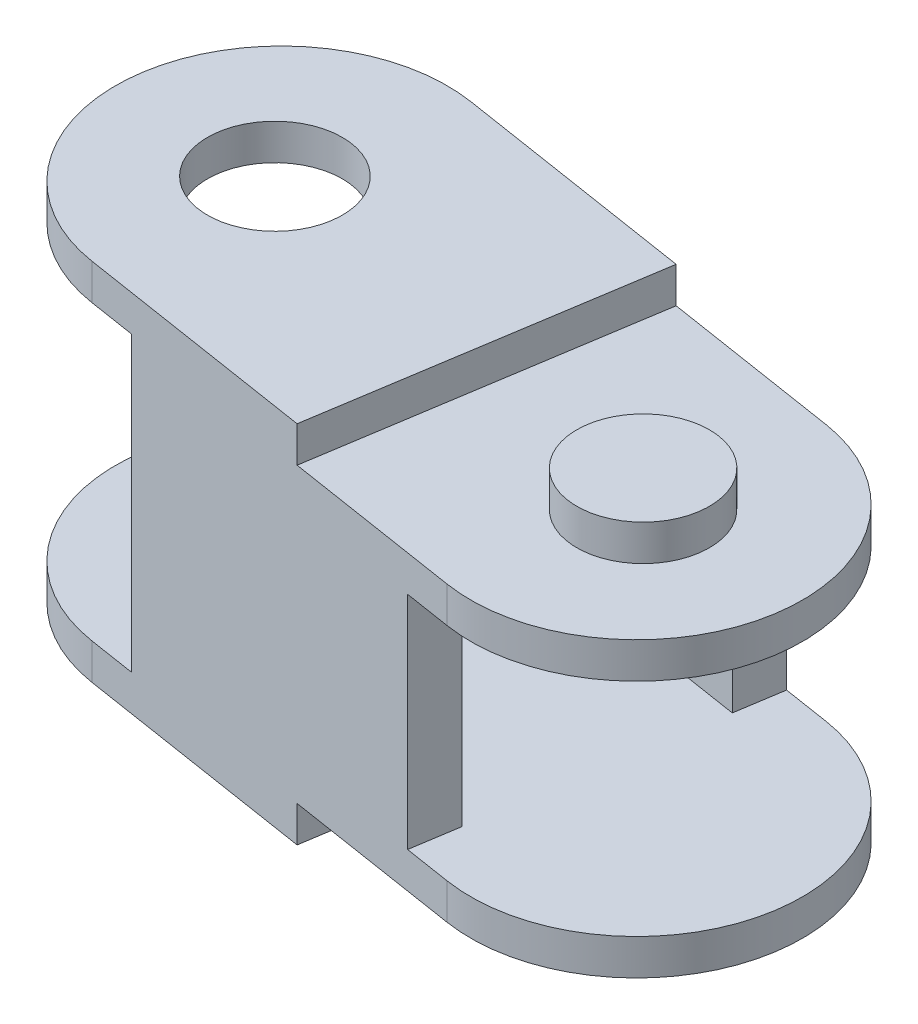
ISO-10303-21;
HEADER;
FILE_DESCRIPTION(('STEP AP214'),'2;1');
FILE_NAME('part.step','',(''),(''),'','','');
FILE_SCHEMA(('AUTOMOTIVE_DESIGN { 1 0 10303 214 1 1 1 1 }'));
ENDSEC;
DATA;
#1=APPLICATION_CONTEXT('core data for automotive mechanical design processes');
#2=APPLICATION_PROTOCOL_DEFINITION('international standard','automotive_design',2000,#1);
#3=PRODUCT_CONTEXT('',#1,'mechanical');
#4=PRODUCT('Part','Part','',(#3));
#5=PRODUCT_RELATED_PRODUCT_CATEGORY('part','',(#4));
#6=PRODUCT_DEFINITION_FORMATION('','',#4);
#7=PRODUCT_DEFINITION_CONTEXT('part definition',#1,'design');
#8=PRODUCT_DEFINITION('design','',#6,#7);
#9=PRODUCT_DEFINITION_SHAPE('','',#8);
#10=(LENGTH_UNIT() NAMED_UNIT(*) SI_UNIT(.MILLI.,.METRE.));
#11=(NAMED_UNIT(*) PLANE_ANGLE_UNIT() SI_UNIT($,.RADIAN.));
#12=(NAMED_UNIT(*) SI_UNIT($,.STERADIAN.) SOLID_ANGLE_UNIT());
#13=UNCERTAINTY_MEASURE_WITH_UNIT(LENGTH_MEASURE(1.E-05),#10,'distance_accuracy_value','');
#14=(GEOMETRIC_REPRESENTATION_CONTEXT(3) GLOBAL_UNCERTAINTY_ASSIGNED_CONTEXT((#13)) GLOBAL_UNIT_ASSIGNED_CONTEXT((#10,
#11,#12)) REPRESENTATION_CONTEXT('',''));
#15=CARTESIAN_POINT('',(0.,0.,0.));
#16=DIRECTION('',(0.,0.,1.));
#17=DIRECTION('',(1.,0.,0.));
#18=AXIS2_PLACEMENT_3D('',#15,#16,#17);
#19=CARTESIAN_POINT('',(-120.000000004537,13.25,55.9999999957728));
#20=DIRECTION('',(0.,1.,0.));
#21=DIRECTION('',(0.,0.,1.));
#22=AXIS2_PLACEMENT_3D('',#19,#20,#21);
#23=PLANE('',#22);
#24=CARTESIAN_POINT('',(-120.000000004537,13.25,55.9999999957728));
#25=DIRECTION('',(0.,-1.,0.));
#26=DIRECTION('',(0.,0.,-1.));
#27=AXIS2_PLACEMENT_3D('',#24,#25,#26);
#28=CIRCLE('',#27,3.);
#29=CARTESIAN_POINT('',(-120.000000004537,13.25,52.9999999957728));
#30=VERTEX_POINT('',#29);
#31=EDGE_CURVE('E20',#30,#30,#28,.T.);
#32=ORIENTED_EDGE('',*,*,#31,.F.);
#33=EDGE_LOOP('',(#32));
#34=FACE_BOUND('',#33,.T.);
#35=ADVANCED_FACE('F17',(#34),#23,.T.);
#36=CARTESIAN_POINT('',(-120.000000004537,-3.25,55.9999999957728));
#37=DIRECTION('',(0.,-1.,0.));
#38=DIRECTION('',(0.,0.,-1.));
#39=AXIS2_PLACEMENT_3D('',#36,#37,#38);
#40=PLANE('',#39);
#41=CARTESIAN_POINT('',(-120.000000004537,-3.25,55.9999999957728));
#42=DIRECTION('',(0.,-1.,0.));
#43=DIRECTION('',(0.,0.,-1.));
#44=AXIS2_PLACEMENT_3D('',#41,#42,#43);
#45=CIRCLE('',#44,3.);
#46=CARTESIAN_POINT('',(-120.000000004537,-3.25,52.9999999957728));
#47=VERTEX_POINT('',#46);
#48=EDGE_CURVE('E301',#47,#47,#45,.F.);
#49=ORIENTED_EDGE('',*,*,#48,.F.);
#50=EDGE_LOOP('',(#49));
#51=FACE_BOUND('',#50,.T.);
#52=ADVANCED_FACE('F418',(#51),#40,.T.);
#53=CARTESIAN_POINT('',(-137.288222963067,5.,53.2857142819716));
#54=DIRECTION('',(-0.987898454773161,0.,-0.155102040788641));
#55=DIRECTION('',(-0.155102040788641,0.,0.987898454773161));
#56=AXIS2_PLACEMENT_3D('',#53,#54,#55);
#57=PLANE('',#56);
#58=DIRECTION('',(0.,1.,0.));
#59=VECTOR('',#58,1.);
#60=CARTESIAN_POINT('',(-136.458427044848,5.,48.0004575489351));
#61=LINE('',#60,#59);
#62=CARTESIAN_POINT('',(-136.458427044848,10.,48.0004575489352));
#63=VERTEX_POINT('',#62);
#64=CARTESIAN_POINT('',(-136.458427044848,0.,48.0004575489352));
#65=VERTEX_POINT('',#64);
#66=EDGE_CURVE('E147',#63,#65,#61,.F.);
#67=ORIENTED_EDGE('',*,*,#66,.F.);
#68=DIRECTION('',(0.15510204078861,0.,-0.987898454773166));
#69=VECTOR('',#68,1.);
#70=CARTESIAN_POINT('',(-136.458427044848,10.,48.0004575489352));
#71=LINE('',#70,#69);
#72=CARTESIAN_POINT('',(-136.158637044364,10.,46.090991517871));
#73=VERTEX_POINT('',#72);
#74=EDGE_CURVE('E344',#63,#73,#71,.T.);
#75=ORIENTED_EDGE('',*,*,#74,.T.);
#76=DIRECTION('',(0.,1.,0.));
#77=VECTOR('',#76,1.);
#78=CARTESIAN_POINT('',(-136.158637044364,5.,46.090991517871));
#79=LINE('',#78,#77);
#80=CARTESIAN_POINT('',(-136.158637044364,11.625,46.090991517871));
#81=VERTEX_POINT('',#80);
#82=EDGE_CURVE('E162',#73,#81,#79,.T.);
#83=ORIENTED_EDGE('',*,*,#82,.T.);
#84=DIRECTION('',(-0.155102040788641,0.,0.987898454773161));
#85=VECTOR('',#84,1.);
#86=CARTESIAN_POINT('',(-137.288222963067,11.625,53.2857142819716));
#87=LINE('',#86,#85);
#88=CARTESIAN_POINT('',(-136.124957657152,11.625,45.8764758711729));
#89=VERTEX_POINT('',#88);
#90=EDGE_CURVE('E157',#81,#89,#87,.F.);
#91=ORIENTED_EDGE('',*,*,#90,.T.);
#92=DIRECTION('',(0.,1.,0.));
#93=VECTOR('',#92,1.);
#94=CARTESIAN_POINT('',(-136.124957657152,-3.25,45.876475871173));
#95=LINE('',#94,#93);
#96=CARTESIAN_POINT('',(-136.124957657152,-1.625,45.8764758711729));
#97=VERTEX_POINT('',#96);
#98=EDGE_CURVE('E160',#97,#89,#95,.T.);
#99=ORIENTED_EDGE('',*,*,#98,.F.);
#100=DIRECTION('',(-0.155102040788641,0.,0.987898454773161));
#101=VECTOR('',#100,1.);
#102=CARTESIAN_POINT('',(-137.288222963067,-1.625,53.2857142819716));
#103=LINE('',#102,#101);
#104=CARTESIAN_POINT('',(-136.158637044364,-1.625,46.090991517871));
#105=VERTEX_POINT('',#104);
#106=EDGE_CURVE('E166',#97,#105,#103,.T.);
#107=ORIENTED_EDGE('',*,*,#106,.T.);
#108=DIRECTION('',(0.,-1.,0.));
#109=VECTOR('',#108,1.);
#110=CARTESIAN_POINT('',(-136.158637044364,-0.8125,46.0909915178709));
#111=LINE('',#110,#109);
#112=CARTESIAN_POINT('',(-136.158637044364,0.,46.0909915178709));
#113=VERTEX_POINT('',#112);
#114=EDGE_CURVE('E141',#105,#113,#111,.F.);
#115=ORIENTED_EDGE('',*,*,#114,.T.);
#116=DIRECTION('',(-0.15510204078861,0.,0.987898454773166));
#117=VECTOR('',#116,1.);
#118=CARTESIAN_POINT('',(-136.158637044364,0.,46.090991517871));
#119=LINE('',#118,#117);
#120=EDGE_CURVE('E346',#113,#65,#119,.T.);
#121=ORIENTED_EDGE('',*,*,#120,.T.);
#122=EDGE_LOOP('',(#67,#75,#83,#91,#99,#107,#115,#121));
#123=FACE_BOUND('',#122,.T.);
#124=ADVANCED_FACE('F159',(#123),#57,.T.);
#125=CARTESIAN_POINT('',(-139.7579691,0.,52.89795918));
#126=DIRECTION('',(0.,1.,0.));
#127=DIRECTION('',(0.,0.,1.));
#128=AXIS2_PLACEMENT_3D('',#125,#126,#127);
#129=PLANE('',#128);
#130=CARTESIAN_POINT('',(-139.7579691,0.,52.89795918));
#131=DIRECTION('',(0.,-1.,0.));
#132=DIRECTION('',(0.,0.,-1.));
#133=AXIS2_PLACEMENT_3D('',#130,#131,#132);
#134=CIRCLE('',#133,7.7);
#135=CARTESIAN_POINT('',(-133.457364932623,0.,48.471630325743));
#136=VERTEX_POINT('',#135);
#137=EDGE_CURVE('E315',#113,#136,#134,.T.);
#138=ORIENTED_EDGE('',*,*,#137,.T.);
#139=DIRECTION('',(0.987898454773161,0.,0.155102040788641));
#140=VECTOR('',#139,1.);
#141=CARTESIAN_POINT('',(-126.579442497116,0.,49.5514779568216));
#142=LINE('',#141,#140);
#143=EDGE_CURVE('E239',#65,#136,#142,.T.);
#144=ORIENTED_EDGE('',*,*,#143,.F.);
#145=ORIENTED_EDGE('',*,*,#120,.F.);
#146=EDGE_LOOP('',(#138,#144,#145));
#147=FACE_BOUND('',#146,.T.);
#148=ADVANCED_FACE('F425',(#147),#129,.F.);
#149=CARTESIAN_POINT('',(-139.7579691,10.,52.89795918));
#150=DIRECTION('',(0.,-1.,0.));
#151=DIRECTION('',(0.,0.,-1.));
#152=AXIS2_PLACEMENT_3D('',#149,#150,#151);
#153=PLANE('',#152);
#154=DIRECTION('',(0.987898454773161,0.,0.155102040788641));
#155=VECTOR('',#154,1.);
#156=CARTESIAN_POINT('',(-126.579442497116,10.,49.5514779568216));
#157=LINE('',#156,#155);
#158=CARTESIAN_POINT('',(-133.457364932623,10.,48.471630325743));
#159=VERTEX_POINT('',#158);
#160=EDGE_CURVE('E230',#159,#63,#157,.F.);
#161=ORIENTED_EDGE('',*,*,#160,.F.);
#162=CARTESIAN_POINT('',(-139.7579691,10.,52.89795918));
#163=DIRECTION('',(0.,-1.,0.));
#164=DIRECTION('',(0.,0.,-1.));
#165=AXIS2_PLACEMENT_3D('',#162,#163,#164);
#166=CIRCLE('',#165,7.7);
#167=EDGE_CURVE('E233',#159,#73,#166,.F.);
#168=ORIENTED_EDGE('',*,*,#167,.T.);
#169=ORIENTED_EDGE('',*,*,#74,.F.);
#170=EDGE_LOOP('',(#161,#168,#169));
#171=FACE_BOUND('',#170,.T.);
#172=ADVANCED_FACE('F541',(#171),#153,.F.);
#173=CARTESIAN_POINT('',(-120.000000004537,12.4375,55.9999999957728));
#174=DIRECTION('',(0.,-1.,0.));
#175=DIRECTION('',(0.,0.,-1.));
#176=AXIS2_PLACEMENT_3D('',#173,#174,#175);
#177=CYLINDRICAL_SURFACE('',#176,3.);
#178=CARTESIAN_POINT('',(-120.000000004537,11.625,55.9999999957728));
#179=DIRECTION('',(0.,-1.,0.));
#180=DIRECTION('',(0.,0.,-1.));
#181=AXIS2_PLACEMENT_3D('',#178,#179,#180);
#182=CIRCLE('',#181,3.);
#183=CARTESIAN_POINT('',(-120.000000004537,11.625,52.9999999957728));
#184=VERTEX_POINT('',#183);
#185=EDGE_CURVE('E404',#184,#184,#182,.T.);
#186=ORIENTED_EDGE('',*,*,#185,.F.);
#187=EDGE_LOOP('',(#186));
#188=FACE_BOUND('',#187,.T.);
#189=ORIENTED_EDGE('',*,*,#31,.T.);
#190=EDGE_LOOP('',(#189));
#191=FACE_BOUND('',#190,.T.);
#192=ADVANCED_FACE('F537',(#188,#191),#177,.T.);
#193=CARTESIAN_POINT('',(-128.397136870109,12.4375,54.6816326490694));
#194=DIRECTION('',(0.987898454773161,0.,0.155102040788641));
#195=DIRECTION('',(0.155102040788641,0.,-0.987898454773161));
#196=AXIS2_PLACEMENT_3D('',#193,#194,#195);
#197=PLANE('',#196);
#198=DIRECTION('',(-0.155102040788601,0.,0.987898454773167));
#199=VECTOR('',#198,1.);
#200=CARTESIAN_POINT('',(-127.233871564194,11.625,47.2723942382707));
#201=LINE('',#200,#199);
#202=CARTESIAN_POINT('',(-127.233871564194,11.625,47.2723942382707));
#203=VERTEX_POINT('',#202);
#204=CARTESIAN_POINT('',(-129.560402176013,11.625,62.0908710598022));
#205=VERTEX_POINT('',#204);
#206=EDGE_CURVE('E217',#203,#205,#201,.T.);
#207=ORIENTED_EDGE('',*,*,#206,.F.);
#208=DIRECTION('',(0.,1.,0.));
#209=VECTOR('',#208,1.);
#210=CARTESIAN_POINT('',(-127.233871564194,-3.25,47.2723942382707));
#211=LINE('',#210,#209);
#212=CARTESIAN_POINT('',(-127.233871564194,13.25,47.2723942382707));
#213=VERTEX_POINT('',#212);
#214=EDGE_CURVE('E258',#213,#203,#211,.F.);
#215=ORIENTED_EDGE('',*,*,#214,.F.);
#216=DIRECTION('',(0.155102040788601,0.,-0.987898454773167));
#217=VECTOR('',#216,1.);
#218=CARTESIAN_POINT('',(-129.560402176023,13.25,62.0908710598681));
#219=LINE('',#218,#217);
#220=CARTESIAN_POINT('',(-129.560402176013,13.25,62.0908710598022));
#221=VERTEX_POINT('',#220);
#222=EDGE_CURVE('E199',#221,#213,#219,.T.);
#223=ORIENTED_EDGE('',*,*,#222,.F.);
#224=DIRECTION('',(0.,1.,0.));
#225=VECTOR('',#224,1.);
#226=CARTESIAN_POINT('',(-129.560402176024,12.4375,62.090871059868));
#227=LINE('',#226,#225);
#228=EDGE_CURVE('E334',#221,#205,#227,.F.);
#229=ORIENTED_EDGE('',*,*,#228,.T.);
#230=EDGE_LOOP('',(#207,#215,#223,#229));
#231=FACE_BOUND('',#230,.T.);
#232=ADVANCED_FACE('F533',(#231),#197,.T.);
#233=CARTESIAN_POINT('',(-139.412204640715,-3.25,52.9522448941927));
#234=DIRECTION('',(0.,-1.,0.));
#235=DIRECTION('',(0.,0.,-1.));
#236=AXIS2_PLACEMENT_3D('',#233,#234,#235);
#237=CYLINDRICAL_SURFACE('',#236,7.5);
#238=CARTESIAN_POINT('',(-139.412204640715,13.25,52.9522448941927));
#239=DIRECTION('',(0.,-1.,0.));
#240=DIRECTION('',(0.,0.,-1.));
#241=AXIS2_PLACEMENT_3D('',#238,#239,#240);
#242=CIRCLE('',#241,7.5);
#243=CARTESIAN_POINT('',(-138.248939334865,13.25,45.5430064834851));
#244=VERTEX_POINT('',#243);
#245=CARTESIAN_POINT('',(-140.575469946679,13.25,60.3614833049837));
#246=VERTEX_POINT('',#245);
#247=EDGE_CURVE('E188',#244,#246,#242,.F.);
#248=ORIENTED_EDGE('',*,*,#247,.F.);
#249=DIRECTION('',(0.,1.,0.));
#250=VECTOR('',#249,1.);
#251=CARTESIAN_POINT('',(-138.248939334915,-3.25,45.5430064834773));
#252=LINE('',#251,#250);
#253=CARTESIAN_POINT('',(-138.248939334865,11.625,45.5430064834851));
#254=VERTEX_POINT('',#253);
#255=EDGE_CURVE('E176',#254,#244,#252,.T.);
#256=ORIENTED_EDGE('',*,*,#255,.F.);
#257=CARTESIAN_POINT('',(-139.412204640715,11.625,52.9522448941927));
#258=DIRECTION('',(0.,-1.,0.));
#259=DIRECTION('',(0.,0.,-1.));
#260=AXIS2_PLACEMENT_3D('',#257,#258,#259);
#261=CIRCLE('',#260,7.5);
#262=CARTESIAN_POINT('',(-140.575469946679,11.625,60.3614833049837));
#263=VERTEX_POINT('',#262);
#264=EDGE_CURVE('E182',#254,#263,#261,.F.);
#265=ORIENTED_EDGE('',*,*,#264,.T.);
#266=DIRECTION('',(0.,-1.,0.));
#267=VECTOR('',#266,1.);
#268=CARTESIAN_POINT('',(-140.575469946729,-3.25,60.3614833049758));
#269=LINE('',#268,#267);
#270=EDGE_CURVE('E306',#263,#246,#269,.F.);
#271=ORIENTED_EDGE('',*,*,#270,.T.);
#272=EDGE_LOOP('',(#248,#256,#265,#271));
#273=FACE_BOUND('',#272,.T.);
#274=ADVANCED_FACE('F529',(#273),#237,.T.);
#275=CARTESIAN_POINT('',(-139.7579691,5.,52.89795918));
#276=DIRECTION('',(0.,-1.,0.));
#277=DIRECTION('',(0.,0.,-1.));
#278=AXIS2_PLACEMENT_3D('',#275,#276,#277);
#279=CYLINDRICAL_SURFACE('',#278,3.05);
#280=CARTESIAN_POINT('',(-139.7579691,11.625,52.89795918));
#281=DIRECTION('',(0.,-1.,0.));
#282=DIRECTION('',(0.,0.,-1.));
#283=AXIS2_PLACEMENT_3D('',#280,#281,#282);
#284=CIRCLE('',#283,3.05);
#285=CARTESIAN_POINT('',(-139.7579691,11.625,49.84795918));
#286=VERTEX_POINT('',#285);
#287=EDGE_CURVE('E186',#286,#286,#284,.T.);
#288=ORIENTED_EDGE('',*,*,#287,.T.);
#289=EDGE_LOOP('',(#288));
#290=FACE_BOUND('',#289,.T.);
#291=CARTESIAN_POINT('',(-139.7579691,13.25,52.89795918));
#292=DIRECTION('',(0.,-1.,0.));
#293=DIRECTION('',(0.,0.,-1.));
#294=AXIS2_PLACEMENT_3D('',#291,#292,#293);
#295=CIRCLE('',#294,3.05);
#296=CARTESIAN_POINT('',(-139.7579691,13.25,49.84795918));
#297=VERTEX_POINT('',#296);
#298=EDGE_CURVE('E211',#297,#297,#295,.T.);
#299=ORIENTED_EDGE('',*,*,#298,.F.);
#300=EDGE_LOOP('',(#299));
#301=FACE_BOUND('',#300,.T.);
#302=ADVANCED_FACE('F525',(#290,#301),#279,.F.);
#303=CARTESIAN_POINT('',(-139.7579691,10.,52.89795918));
#304=DIRECTION('',(0.,-1.,0.));
#305=DIRECTION('',(0.,0.,-1.));
#306=AXIS2_PLACEMENT_3D('',#303,#304,#305);
#307=PLANE('',#306);
#308=CARTESIAN_POINT('',(-139.7579691,10.,52.89795918));
#309=DIRECTION('',(0.,-1.,0.));
#310=DIRECTION('',(0.,0.,-1.));
#311=AXIS2_PLACEMENT_3D('',#308,#309,#310);
#312=CIRCLE('',#311,7.7);
#313=CARTESIAN_POINT('',(-138.41780888177,10.,60.4804370460722));
#314=VERTEX_POINT('',#313);
#315=CARTESIAN_POINT('',(-135.116956769061,10.,59.0421437918158));
#316=VERTEX_POINT('',#315);
#317=EDGE_CURVE('E407',#314,#316,#312,.F.);
#318=ORIENTED_EDGE('',*,*,#317,.T.);
#319=DIRECTION('',(-0.987898454773161,0.,-0.155102040788641));
#320=VECTOR('',#319,1.);
#321=CARTESIAN_POINT('',(-128.239034333555,10.,60.1219914228944));
#322=LINE('',#321,#320);
#323=CARTESIAN_POINT('',(-138.118018881286,10.,58.570971015008));
#324=VERTEX_POINT('',#323);
#325=EDGE_CURVE('E269',#324,#316,#322,.F.);
#326=ORIENTED_EDGE('',*,*,#325,.F.);
#327=DIRECTION('',(-0.155102040788641,0.,0.987898454773161));
#328=VECTOR('',#327,1.);
#329=CARTESIAN_POINT('',(-137.288222963067,10.,53.2857142819716));
#330=LINE('',#329,#328);
#331=EDGE_CURVE('E319',#314,#324,#330,.F.);
#332=ORIENTED_EDGE('',*,*,#331,.F.);
#333=EDGE_LOOP('',(#318,#326,#332));
#334=FACE_BOUND('',#333,.T.);
#335=ADVANCED_FACE('F521',(#334),#307,.F.);
#336=CARTESIAN_POINT('',(-139.7579691,0.,52.89795918));
#337=DIRECTION('',(0.,1.,0.));
#338=DIRECTION('',(0.,0.,1.));
#339=AXIS2_PLACEMENT_3D('',#336,#337,#338);
#340=PLANE('',#339);
#341=DIRECTION('',(-0.987898454773161,0.,-0.155102040788641));
#342=VECTOR('',#341,1.);
#343=CARTESIAN_POINT('',(-128.239034333555,0.,60.1219914228944));
#344=LINE('',#343,#342);
#345=CARTESIAN_POINT('',(-135.116956769061,0.,59.0421437918158));
#346=VERTEX_POINT('',#345);
#347=CARTESIAN_POINT('',(-138.118018881286,0.,58.570971015008));
#348=VERTEX_POINT('',#347);
#349=EDGE_CURVE('E261',#346,#348,#344,.T.);
#350=ORIENTED_EDGE('',*,*,#349,.F.);
#351=CARTESIAN_POINT('',(-139.7579691,0.,52.89795918));
#352=DIRECTION('',(0.,-1.,0.));
#353=DIRECTION('',(0.,0.,-1.));
#354=AXIS2_PLACEMENT_3D('',#351,#352,#353);
#355=CIRCLE('',#354,7.7);
#356=CARTESIAN_POINT('',(-138.41780888177,0.,60.4804370460722));
#357=VERTEX_POINT('',#356);
#358=EDGE_CURVE('E289',#346,#357,#355,.T.);
#359=ORIENTED_EDGE('',*,*,#358,.T.);
#360=DIRECTION('',(-0.155102040788641,0.,0.987898454773161));
#361=VECTOR('',#360,1.);
#362=CARTESIAN_POINT('',(-137.288222963067,0.,53.2857142819716));
#363=LINE('',#362,#361);
#364=EDGE_CURVE('E310',#348,#357,#363,.T.);
#365=ORIENTED_EDGE('',*,*,#364,.F.);
#366=EDGE_LOOP('',(#350,#359,#365));
#367=FACE_BOUND('',#366,.T.);
#368=ADVANCED_FACE('F517',(#367),#340,.F.);
#369=CARTESIAN_POINT('',(-139.7579691,5.,52.89795918));
#370=DIRECTION('',(0.,-1.,0.));
#371=DIRECTION('',(0.,0.,-1.));
#372=AXIS2_PLACEMENT_3D('',#369,#370,#371);
#373=CYLINDRICAL_SURFACE('',#372,3.05);
#374=CARTESIAN_POINT('',(-139.7579691,-1.62499999999999,52.89795918));
#375=DIRECTION('',(0.,-1.,0.));
#376=DIRECTION('',(0.,0.,-1.));
#377=AXIS2_PLACEMENT_3D('',#374,#375,#376);
#378=CIRCLE('',#377,3.05);
#379=CARTESIAN_POINT('',(-139.7579691,-1.62499999999999,49.84795918));
#380=VERTEX_POINT('',#379);
#381=EDGE_CURVE('E393',#380,#380,#378,.T.);
#382=ORIENTED_EDGE('',*,*,#381,.F.);
#383=EDGE_LOOP('',(#382));
#384=FACE_BOUND('',#383,.T.);
#385=CARTESIAN_POINT('',(-139.7579691,-3.25,52.89795918));
#386=DIRECTION('',(0.,-1.,0.));
#387=DIRECTION('',(0.,0.,-1.));
#388=AXIS2_PLACEMENT_3D('',#385,#386,#387);
#389=CIRCLE('',#388,3.05);
#390=CARTESIAN_POINT('',(-139.7579691,-3.25,49.84795918));
#391=VERTEX_POINT('',#390);
#392=EDGE_CURVE('E384',#391,#391,#389,.T.);
#393=ORIENTED_EDGE('',*,*,#392,.T.);
#394=EDGE_LOOP('',(#393));
#395=FACE_BOUND('',#394,.T.);
#396=ADVANCED_FACE('F513',(#384,#395),#373,.F.);
#397=CARTESIAN_POINT('',(-139.412204640715,-3.25,52.9522448941927));
#398=DIRECTION('',(0.,-1.,0.));
#399=DIRECTION('',(0.,0.,-1.));
#400=AXIS2_PLACEMENT_3D('',#397,#398,#399);
#401=CYLINDRICAL_SURFACE('',#400,7.5);
#402=CARTESIAN_POINT('',(-139.412204640715,-3.25,52.9522448941927));
#403=DIRECTION('',(0.,-1.,0.));
#404=DIRECTION('',(0.,0.,-1.));
#405=AXIS2_PLACEMENT_3D('',#402,#403,#404);
#406=CIRCLE('',#405,7.5);
#407=CARTESIAN_POINT('',(-138.248939334865,-3.25,45.5430064834851));
#408=VERTEX_POINT('',#407);
#409=CARTESIAN_POINT('',(-140.575469946679,-3.25,60.3614833049837));
#410=VERTEX_POINT('',#409);
#411=EDGE_CURVE('E380',#408,#410,#406,.F.);
#412=ORIENTED_EDGE('',*,*,#411,.T.);
#413=DIRECTION('',(0.,-1.,0.));
#414=VECTOR('',#413,1.);
#415=CARTESIAN_POINT('',(-140.575469946729,-3.25,60.3614833049758));
#416=LINE('',#415,#414);
#417=CARTESIAN_POINT('',(-140.575469946679,-1.625,60.3614833049837));
#418=VERTEX_POINT('',#417);
#419=EDGE_CURVE('E304',#410,#418,#416,.F.);
#420=ORIENTED_EDGE('',*,*,#419,.T.);
#421=CARTESIAN_POINT('',(-139.412204640715,-1.625,52.9522448941927));
#422=DIRECTION('',(0.,-1.,0.));
#423=DIRECTION('',(0.,0.,-1.));
#424=AXIS2_PLACEMENT_3D('',#421,#422,#423);
#425=CIRCLE('',#424,7.5);
#426=CARTESIAN_POINT('',(-138.248939334865,-1.625,45.5430064834851));
#427=VERTEX_POINT('',#426);
#428=EDGE_CURVE('E390',#427,#418,#425,.F.);
#429=ORIENTED_EDGE('',*,*,#428,.F.);
#430=DIRECTION('',(0.,1.,0.));
#431=VECTOR('',#430,1.);
#432=CARTESIAN_POINT('',(-138.248939334915,-3.25,45.5430064834773));
#433=LINE('',#432,#431);
#434=EDGE_CURVE('E177',#408,#427,#433,.T.);
#435=ORIENTED_EDGE('',*,*,#434,.F.);
#436=EDGE_LOOP('',(#412,#420,#429,#435));
#437=FACE_BOUND('',#436,.T.);
#438=ADVANCED_FACE('F509',(#437),#401,.T.);
#439=CARTESIAN_POINT('',(-120.000000004537,-2.4375,55.9999999957728));
#440=DIRECTION('',(0.,-1.,0.));
#441=DIRECTION('',(0.,0.,-1.));
#442=AXIS2_PLACEMENT_3D('',#439,#440,#441);
#443=CYLINDRICAL_SURFACE('',#442,3.);
#444=CARTESIAN_POINT('',(-120.000000004537,-1.625,55.9999999957728));
#445=DIRECTION('',(0.,-1.,0.));
#446=DIRECTION('',(0.,0.,-1.));
#447=AXIS2_PLACEMENT_3D('',#444,#445,#446);
#448=CIRCLE('',#447,3.);
#449=CARTESIAN_POINT('',(-120.000000004537,-1.625,52.9999999957728));
#450=VERTEX_POINT('',#449);
#451=EDGE_CURVE('E375',#450,#450,#448,.F.);
#452=ORIENTED_EDGE('',*,*,#451,.F.);
#453=EDGE_LOOP('',(#452));
#454=FACE_BOUND('',#453,.T.);
#455=ORIENTED_EDGE('',*,*,#48,.T.);
#456=EDGE_LOOP('',(#455));
#457=FACE_BOUND('',#456,.T.);
#458=ADVANCED_FACE('F416',(#454,#457),#443,.T.);
#459=CARTESIAN_POINT('',(-128.397136870109,-2.4375,54.6816326490694));
#460=DIRECTION('',(0.987898454773161,0.,0.155102040788641));
#461=DIRECTION('',(0.155102040788641,0.,-0.987898454773161));
#462=AXIS2_PLACEMENT_3D('',#459,#460,#461);
#463=PLANE('',#462);
#464=DIRECTION('',(0.155102040788601,0.,-0.987898454773167));
#465=VECTOR('',#464,1.);
#466=CARTESIAN_POINT('',(-129.560402176023,-3.25,62.0908710598681));
#467=LINE('',#466,#465);
#468=CARTESIAN_POINT('',(-129.560402176013,-3.25,62.0908710598022));
#469=VERTEX_POINT('',#468);
#470=CARTESIAN_POINT('',(-127.233871564194,-3.25,47.2723942382707));
#471=VERTEX_POINT('',#470);
#472=EDGE_CURVE('E379',#469,#471,#467,.T.);
#473=ORIENTED_EDGE('',*,*,#472,.T.);
#474=DIRECTION('',(0.,1.,0.));
#475=VECTOR('',#474,1.);
#476=CARTESIAN_POINT('',(-127.233871564194,-3.25,47.2723942382707));
#477=LINE('',#476,#475);
#478=CARTESIAN_POINT('',(-127.233871564194,-1.625,47.2723942382707));
#479=VERTEX_POINT('',#478);
#480=EDGE_CURVE('E286',#479,#471,#477,.F.);
#481=ORIENTED_EDGE('',*,*,#480,.F.);
#482=DIRECTION('',(0.155102040788601,0.,-0.987898454773167));
#483=VECTOR('',#482,1.);
#484=CARTESIAN_POINT('',(-129.560402176023,-1.625,62.0908710598681));
#485=LINE('',#484,#483);
#486=CARTESIAN_POINT('',(-129.560402176013,-1.625,62.0908710598022));
#487=VERTEX_POINT('',#486);
#488=EDGE_CURVE('E378',#487,#479,#485,.T.);
#489=ORIENTED_EDGE('',*,*,#488,.F.);
#490=DIRECTION('',(0.,1.,0.));
#491=VECTOR('',#490,1.);
#492=CARTESIAN_POINT('',(-129.560402176024,-2.4375,62.090871059868));
#493=LINE('',#492,#491);
#494=EDGE_CURVE('E298',#487,#469,#493,.F.);
#495=ORIENTED_EDGE('',*,*,#494,.T.);
#496=EDGE_LOOP('',(#473,#481,#489,#495));
#497=FACE_BOUND('',#496,.T.);
#498=ADVANCED_FACE('F502',(#497),#463,.T.);
#499=CARTESIAN_POINT('',(-139.7579691,-0.8125,52.89795918));
#500=DIRECTION('',(0.,-1.,0.));
#501=DIRECTION('',(0.,0.,-1.));
#502=AXIS2_PLACEMENT_3D('',#499,#500,#501);
#503=CYLINDRICAL_SURFACE('',#502,7.7);
#504=CARTESIAN_POINT('',(-139.7579691,-1.625,52.89795918));
#505=DIRECTION('',(0.,-1.,0.));
#506=DIRECTION('',(0.,0.,-1.));
#507=AXIS2_PLACEMENT_3D('',#504,#505,#506);
#508=CIRCLE('',#507,7.7);
#509=CARTESIAN_POINT('',(-138.41780888177,-1.625,60.4804370460721));
#510=VERTEX_POINT('',#509);
#511=EDGE_CURVE('E387',#510,#105,#508,.F.);
#512=ORIENTED_EDGE('',*,*,#511,.F.);
#513=DIRECTION('',(0.,1.,0.));
#514=VECTOR('',#513,1.);
#515=CARTESIAN_POINT('',(-138.41780888177,5.,60.4804370460722));
#516=LINE('',#515,#514);
#517=EDGE_CURVE('E308',#357,#510,#516,.F.);
#518=ORIENTED_EDGE('',*,*,#517,.F.);
#519=ORIENTED_EDGE('',*,*,#358,.F.);
#520=CARTESIAN_POINT('',(-139.7579691,0.,52.89795918));
#521=DIRECTION('',(0.,-1.,0.));
#522=DIRECTION('',(0.,0.,-1.));
#523=AXIS2_PLACEMENT_3D('',#520,#521,#522);
#524=CIRCLE('',#523,7.7);
#525=EDGE_CURVE('E369',#136,#346,#524,.T.);
#526=ORIENTED_EDGE('',*,*,#525,.F.);
#527=ORIENTED_EDGE('',*,*,#137,.F.);
#528=ORIENTED_EDGE('',*,*,#114,.F.);
#529=EDGE_LOOP('',(#512,#518,#519,#526,#527,#528));
#530=FACE_BOUND('',#529,.T.);
#531=ADVANCED_FACE('F498',(#530),#503,.F.);
#532=CARTESIAN_POINT('',(-120.345764463822,-3.25,55.9457142815801));
#533=DIRECTION('',(0.,-1.,0.));
#534=DIRECTION('',(0.,0.,-1.));
#535=AXIS2_PLACEMENT_3D('',#532,#533,#534);
#536=CYLINDRICAL_SURFACE('',#535,7.50000000000001);
#537=CARTESIAN_POINT('',(-120.345764463822,0.,55.9457142815801));
#538=DIRECTION('',(0.,-1.,0.));
#539=DIRECTION('',(0.,0.,-1.));
#540=AXIS2_PLACEMENT_3D('',#537,#538,#539);
#541=CIRCLE('',#540,7.50000000000001);
#542=CARTESIAN_POINT('',(-121.509029769656,0.,63.354952692189));
#543=VERTEX_POINT('',#542);
#544=CARTESIAN_POINT('',(-119.182499157891,0.,48.5364758706826));
#545=VERTEX_POINT('',#544);
#546=EDGE_CURVE('E365',#543,#545,#541,.F.);
#547=ORIENTED_EDGE('',*,*,#546,.F.);
#548=DIRECTION('',(0.,-1.,0.));
#549=VECTOR('',#548,1.);
#550=CARTESIAN_POINT('',(-121.509029769607,-3.25,63.3549526921967));
#551=LINE('',#550,#549);
#552=CARTESIAN_POINT('',(-121.509029769656,-1.625,63.354952692189));
#553=VERTEX_POINT('',#552);
#554=EDGE_CURVE('E272',#543,#553,#551,.T.);
#555=ORIENTED_EDGE('',*,*,#554,.T.);
#556=CARTESIAN_POINT('',(-120.345764463822,-1.625,55.9457142815801));
#557=DIRECTION('',(0.,-1.,0.));
#558=DIRECTION('',(0.,0.,-1.));
#559=AXIS2_PLACEMENT_3D('',#556,#557,#558);
#560=CIRCLE('',#559,7.50000000000001);
#561=CARTESIAN_POINT('',(-119.182499157891,-1.625,48.5364758706826));
#562=VERTEX_POINT('',#561);
#563=EDGE_CURVE('E372',#562,#553,#560,.T.);
#564=ORIENTED_EDGE('',*,*,#563,.F.);
#565=DIRECTION('',(0.,1.,0.));
#566=VECTOR('',#565,1.);
#567=CARTESIAN_POINT('',(-119.182499157891,-3.25,48.5364758706827));
#568=LINE('',#567,#566);
#569=EDGE_CURVE('E257',#545,#562,#568,.F.);
#570=ORIENTED_EDGE('',*,*,#569,.F.);
#571=EDGE_LOOP('',(#547,#555,#564,#570));
#572=FACE_BOUND('',#571,.T.);
#573=ADVANCED_FACE('F494',(#572),#536,.T.);
#574=CARTESIAN_POINT('',(-128.239034333555,5.,60.1219914228944));
#575=DIRECTION('',(0.155102040788641,0.,-0.987898454773161));
#576=DIRECTION('',(-0.987898454773161,0.,-0.155102040788641));
#577=AXIS2_PLACEMENT_3D('',#574,#575,#576);
#578=PLANE('',#577);
#579=DIRECTION('',(0.987898454773161,0.,0.155102040788641));
#580=VECTOR('',#579,1.);
#581=CARTESIAN_POINT('',(-135.116956769061,0.,59.0421437918158));
#582=LINE('',#581,#580);
#583=CARTESIAN_POINT('',(-123.299542059689,0.,60.8975016268376));
#584=VERTEX_POINT('',#583);
#585=EDGE_CURVE('E368',#346,#584,#582,.T.);
#586=ORIENTED_EDGE('',*,*,#585,.F.);
#587=ORIENTED_EDGE('',*,*,#349,.T.);
#588=DIRECTION('',(0.,1.,0.));
#589=VECTOR('',#588,1.);
#590=CARTESIAN_POINT('',(-138.118018881286,5.,58.570971015008));
#591=LINE('',#590,#589);
#592=EDGE_CURVE('E322',#324,#348,#591,.F.);
#593=ORIENTED_EDGE('',*,*,#592,.F.);
#594=ORIENTED_EDGE('',*,*,#325,.T.);
#595=DIRECTION('',(0.987898454773161,0.,0.155102040788641));
#596=VECTOR('',#595,1.);
#597=CARTESIAN_POINT('',(-135.116956769061,10.,59.0421437918158));
#598=LINE('',#597,#596);
#599=CARTESIAN_POINT('',(-123.299542059689,10.,60.8975016268376));
#600=VERTEX_POINT('',#599);
#601=EDGE_CURVE('E668',#316,#600,#598,.T.);
#602=ORIENTED_EDGE('',*,*,#601,.T.);
#603=DIRECTION('',(0.,1.,0.));
#604=VECTOR('',#603,1.);
#605=CARTESIAN_POINT('',(-123.299542059689,5.,60.8975016268376));
#606=LINE('',#605,#604);
#607=EDGE_CURVE('E262',#584,#600,#606,.T.);
#608=ORIENTED_EDGE('',*,*,#607,.F.);
#609=EDGE_LOOP('',(#586,#587,#593,#594,#602,#608));
#610=FACE_BOUND('',#609,.T.);
#611=ADVANCED_FACE('F490',(#610),#578,.T.);
#612=CARTESIAN_POINT('',(-120.345764463822,-3.25,55.9457142815801));
#613=DIRECTION('',(0.,-1.,0.));
#614=DIRECTION('',(0.,0.,-1.));
#615=AXIS2_PLACEMENT_3D('',#612,#613,#614);
#616=CYLINDRICAL_SURFACE('',#615,7.50000000000001);
#617=CARTESIAN_POINT('',(-120.345764463822,10.,55.9457142815801));
#618=DIRECTION('',(0.,-1.,0.));
#619=DIRECTION('',(0.,0.,-1.));
#620=AXIS2_PLACEMENT_3D('',#617,#618,#619);
#621=CIRCLE('',#620,7.50000000000001);
#622=CARTESIAN_POINT('',(-121.509029769706,10.,63.3549526921812));
#623=VERTEX_POINT('',#622);
#624=CARTESIAN_POINT('',(-119.182499157891,10.,48.5364758706826));
#625=VERTEX_POINT('',#624);
#626=EDGE_CURVE('E35',#623,#625,#621,.F.);
#627=ORIENTED_EDGE('',*,*,#626,.T.);
#628=DIRECTION('',(0.,1.,0.));
#629=VECTOR('',#628,1.);
#630=CARTESIAN_POINT('',(-119.182499157891,-3.25,48.5364758706827));
#631=LINE('',#630,#629);
#632=CARTESIAN_POINT('',(-119.182499157891,11.625,48.5364758706826));
#633=VERTEX_POINT('',#632);
#634=EDGE_CURVE('E254',#633,#625,#631,.F.);
#635=ORIENTED_EDGE('',*,*,#634,.F.);
#636=CARTESIAN_POINT('',(-120.345764463822,11.625,55.9457142815801));
#637=DIRECTION('',(0.,-1.,0.));
#638=DIRECTION('',(0.,0.,-1.));
#639=AXIS2_PLACEMENT_3D('',#636,#637,#638);
#640=CIRCLE('',#639,7.50000000000001);
#641=CARTESIAN_POINT('',(-121.509029769706,11.625,63.3549526921812));
#642=VERTEX_POINT('',#641);
#643=EDGE_CURVE('E218',#642,#633,#640,.F.);
#644=ORIENTED_EDGE('',*,*,#643,.F.);
#645=DIRECTION('',(0.,-1.,0.));
#646=VECTOR('',#645,1.);
#647=CARTESIAN_POINT('',(-121.509029769705,-3.25,63.3549526921813));
#648=LINE('',#647,#646);
#649=EDGE_CURVE('E259',#642,#623,#648,.T.);
#650=ORIENTED_EDGE('',*,*,#649,.T.);
#651=EDGE_LOOP('',(#627,#635,#644,#650));
#652=FACE_BOUND('',#651,.T.);
#653=ADVANCED_FACE('F487',(#652),#616,.T.);
#654=CARTESIAN_POINT('',(-138.248939334915,-3.25,45.5430064834773));
#655=DIRECTION('',(0.155102040788641,0.,-0.987898454773161));
#656=DIRECTION('',(-0.987898454773161,0.,-0.155102040788641));
#657=AXIS2_PLACEMENT_3D('',#654,#655,#656);
#658=PLANE('',#657);
#659=ORIENTED_EDGE('',*,*,#255,.T.);
#660=DIRECTION('',(-0.987898454773161,0.,-0.155102040788642));
#661=VECTOR('',#660,1.);
#662=CARTESIAN_POINT('',(-127.233871564194,13.25,47.2723942382707));
#663=LINE('',#662,#661);
#664=EDGE_CURVE('E196',#213,#244,#663,.T.);
#665=ORIENTED_EDGE('',*,*,#664,.F.);
#666=ORIENTED_EDGE('',*,*,#214,.T.);
#667=DIRECTION('',(-0.987898454773162,0.,-0.15510204078863));
#668=VECTOR('',#667,1.);
#669=CARTESIAN_POINT('',(-119.182499157891,11.625,48.5364758706826));
#670=LINE('',#669,#668);
#671=EDGE_CURVE('E214',#633,#203,#670,.T.);
#672=ORIENTED_EDGE('',*,*,#671,.F.);
#673=ORIENTED_EDGE('',*,*,#634,.T.);
#674=DIRECTION('',(-0.987898454773164,0.,-0.155102040788623));
#675=VECTOR('',#674,1.);
#676=CARTESIAN_POINT('',(-119.182499157891,10.,48.5364758706826));
#677=LINE('',#676,#675);
#678=CARTESIAN_POINT('',(-121.306480835555,10.,48.2030064830025));
#679=VERTEX_POINT('',#678);
#680=EDGE_CURVE('E246',#625,#679,#677,.T.);
#681=ORIENTED_EDGE('',*,*,#680,.T.);
#682=DIRECTION('',(0.,1.,0.));
#683=VECTOR('',#682,1.);
#684=CARTESIAN_POINT('',(-121.306480835555,5.,48.2030064830025));
#685=LINE('',#684,#683);
#686=CARTESIAN_POINT('',(-121.306480835555,0.,48.2030064830025));
#687=VERTEX_POINT('',#686);
#688=EDGE_CURVE('E249',#687,#679,#685,.T.);
#689=ORIENTED_EDGE('',*,*,#688,.F.);
#690=DIRECTION('',(-0.987898454773164,0.,-0.155102040788623));
#691=VECTOR('',#690,1.);
#692=CARTESIAN_POINT('',(-119.182499157891,0.,48.5364758706826));
#693=LINE('',#692,#691);
#694=EDGE_CURVE('E282',#545,#687,#693,.T.);
#695=ORIENTED_EDGE('',*,*,#694,.F.);
#696=ORIENTED_EDGE('',*,*,#569,.T.);
#697=DIRECTION('',(0.987898454773162,0.,0.15510204078863));
#698=VECTOR('',#697,1.);
#699=CARTESIAN_POINT('',(-127.233871564194,-1.625,47.2723942382707));
#700=LINE('',#699,#698);
#701=EDGE_CURVE('E374',#479,#562,#700,.T.);
#702=ORIENTED_EDGE('',*,*,#701,.F.);
#703=ORIENTED_EDGE('',*,*,#480,.T.);
#704=DIRECTION('',(-0.987898454773161,0.,-0.155102040788642));
#705=VECTOR('',#704,1.);
#706=CARTESIAN_POINT('',(-127.233871564194,-3.25,47.2723942382707));
#707=LINE('',#706,#705);
#708=EDGE_CURVE('E383',#471,#408,#707,.T.);
#709=ORIENTED_EDGE('',*,*,#708,.T.);
#710=ORIENTED_EDGE('',*,*,#434,.T.);
#711=DIRECTION('',(-0.987898454773166,0.,-0.155102040788606));
#712=VECTOR('',#711,1.);
#713=CARTESIAN_POINT('',(-136.124957657152,-1.625,45.8764758711729));
#714=LINE('',#713,#712);
#715=EDGE_CURVE('E175',#97,#427,#714,.T.);
#716=ORIENTED_EDGE('',*,*,#715,.F.);
#717=ORIENTED_EDGE('',*,*,#98,.T.);
#718=DIRECTION('',(-0.987898454773166,0.,-0.155102040788606));
#719=VECTOR('',#718,1.);
#720=CARTESIAN_POINT('',(-136.124957657152,11.625,45.8764758711729));
#721=LINE('',#720,#719);
#722=EDGE_CURVE('E172',#89,#254,#721,.T.);
#723=ORIENTED_EDGE('',*,*,#722,.T.);
#724=EDGE_LOOP('',(#659,#665,#666,#672,#673,#681,#689,#695,#696,#702,#703,#709,#710,#716,#717,#723));
#725=FACE_BOUND('',#724,.T.);
#726=ADVANCED_FACE('F171',(#725),#658,.T.);
#727=CARTESIAN_POINT('',(-122.46974614147,5.,55.6122448938012));
#728=DIRECTION('',(0.987898454773161,0.,0.155102040788641));
#729=DIRECTION('',(0.155102040788641,0.,-0.987898454773161));
#730=AXIS2_PLACEMENT_3D('',#727,#728,#729);
#731=PLANE('',#730);
#732=ORIENTED_EDGE('',*,*,#688,.T.);
#733=DIRECTION('',(-0.155102040788374,0.,0.987898454773203));
#734=VECTOR('',#733,1.);
#735=CARTESIAN_POINT('',(-121.306480835555,10.,48.2030064830025));
#736=LINE('',#735,#734);
#737=CARTESIAN_POINT('',(-121.63995022325,10.,50.3269881607648));
#738=VERTEX_POINT('',#737);
#739=EDGE_CURVE('E242',#679,#738,#736,.T.);
#740=ORIENTED_EDGE('',*,*,#739,.T.);
#741=DIRECTION('',(0.,1.,0.));
#742=VECTOR('',#741,1.);
#743=CARTESIAN_POINT('',(-121.63995022325,5.,50.3269881607648));
#744=LINE('',#743,#742);
#745=CARTESIAN_POINT('',(-121.63995022325,0.,50.3269881607648));
#746=VERTEX_POINT('',#745);
#747=EDGE_CURVE('E234',#746,#738,#744,.T.);
#748=ORIENTED_EDGE('',*,*,#747,.F.);
#749=DIRECTION('',(-0.155102040788374,0.,0.987898454773203));
#750=VECTOR('',#749,1.);
#751=CARTESIAN_POINT('',(-121.306480835555,0.,48.2030064830025));
#752=LINE('',#751,#750);
#753=EDGE_CURVE('E279',#687,#746,#752,.T.);
#754=ORIENTED_EDGE('',*,*,#753,.F.);
#755=EDGE_LOOP('',(#732,#740,#748,#754));
#756=FACE_BOUND('',#755,.T.);
#757=ADVANCED_FACE('F480',(#756),#731,.T.);
#758=CARTESIAN_POINT('',(-126.579442497116,5.,49.5514779568216));
#759=DIRECTION('',(-0.155102040788641,0.,0.987898454773161));
#760=DIRECTION('',(0.987898454773161,0.,0.155102040788641));
#761=AXIS2_PLACEMENT_3D('',#758,#759,#760);
#762=PLANE('',#761);
#763=DIRECTION('',(-0.987898454773163,0.,-0.155102040788629));
#764=VECTOR('',#763,1.);
#765=CARTESIAN_POINT('',(-121.63995022325,10.,50.3269881607648));
#766=LINE('',#765,#764);
#767=EDGE_CURVE('E245',#738,#159,#766,.T.);
#768=ORIENTED_EDGE('',*,*,#767,.T.);
#769=ORIENTED_EDGE('',*,*,#160,.T.);
#770=ORIENTED_EDGE('',*,*,#66,.T.);
#771=ORIENTED_EDGE('',*,*,#143,.T.);
#772=DIRECTION('',(-0.987898454773163,0.,-0.155102040788629));
#773=VECTOR('',#772,1.);
#774=CARTESIAN_POINT('',(-121.63995022325,0.,50.3269881607648));
#775=LINE('',#774,#773);
#776=EDGE_CURVE('E266',#746,#136,#775,.T.);
#777=ORIENTED_EDGE('',*,*,#776,.F.);
#778=ORIENTED_EDGE('',*,*,#747,.T.);
#779=EDGE_LOOP('',(#768,#769,#770,#771,#777,#778));
#780=FACE_BOUND('',#779,.T.);
#781=ADVANCED_FACE('F476',(#780),#762,.T.);
#782=CARTESIAN_POINT('',(-139.7579691,10.8125,52.89795918));
#783=DIRECTION('',(0.,-1.,0.));
#784=DIRECTION('',(0.,0.,-1.));
#785=AXIS2_PLACEMENT_3D('',#782,#783,#784);
#786=CYLINDRICAL_SURFACE('',#785,7.7);
#787=CARTESIAN_POINT('',(-139.7579691,10.,52.89795918));
#788=DIRECTION('',(0.,-1.,0.));
#789=DIRECTION('',(0.,0.,-1.));
#790=AXIS2_PLACEMENT_3D('',#787,#788,#789);
#791=CIRCLE('',#790,7.7);
#792=EDGE_CURVE('E223',#159,#316,#791,.T.);
#793=ORIENTED_EDGE('',*,*,#792,.T.);
#794=ORIENTED_EDGE('',*,*,#317,.F.);
#795=DIRECTION('',(0.,1.,0.));
#796=VECTOR('',#795,1.);
#797=CARTESIAN_POINT('',(-138.41780888177,5.,60.4804370460722));
#798=LINE('',#797,#796);
#799=CARTESIAN_POINT('',(-138.41780888177,11.625,60.4804370460722));
#800=VERTEX_POINT('',#799);
#801=EDGE_CURVE('E316',#800,#314,#798,.F.);
#802=ORIENTED_EDGE('',*,*,#801,.F.);
#803=CARTESIAN_POINT('',(-139.7579691,11.625,52.89795918));
#804=DIRECTION('',(0.,-1.,0.));
#805=DIRECTION('',(0.,0.,-1.));
#806=AXIS2_PLACEMENT_3D('',#803,#804,#805);
#807=CIRCLE('',#806,7.7);
#808=EDGE_CURVE('E184',#800,#81,#807,.F.);
#809=ORIENTED_EDGE('',*,*,#808,.T.);
#810=ORIENTED_EDGE('',*,*,#82,.F.);
#811=ORIENTED_EDGE('',*,*,#167,.F.);
#812=EDGE_LOOP('',(#793,#794,#802,#809,#810,#811));
#813=FACE_BOUND('',#812,.T.);
#814=ADVANCED_FACE('F472',(#813),#786,.F.);
#815=CARTESIAN_POINT('',(-111.454678370749,11.625,57.3416326485946));
#816=DIRECTION('',(0.,1.,0.));
#817=DIRECTION('',(0.,0.,1.));
#818=AXIS2_PLACEMENT_3D('',#815,#816,#817);
#819=PLANE('',#818);
#820=ORIENTED_EDGE('',*,*,#206,.T.);
#821=DIRECTION('',(0.987898454773161,0.,0.155102040788641));
#822=VECTOR('',#821,1.);
#823=CARTESIAN_POINT('',(-121.509029769607,11.625,63.3549526921967));
#824=LINE('',#823,#822);
#825=EDGE_CURVE('E206',#642,#205,#824,.F.);
#826=ORIENTED_EDGE('',*,*,#825,.F.);
#827=ORIENTED_EDGE('',*,*,#643,.T.);
#828=ORIENTED_EDGE('',*,*,#671,.T.);
#829=EDGE_LOOP('',(#820,#826,#827,#828));
#830=FACE_BOUND('',#829,.T.);
#831=ORIENTED_EDGE('',*,*,#185,.T.);
#832=EDGE_LOOP('',(#831));
#833=FACE_BOUND('',#832,.T.);
#834=ADVANCED_FACE('F468',(#830,#833),#819,.T.);
#835=CARTESIAN_POINT('',(-129.878984552268,13.25,54.4489795878864));
#836=DIRECTION('',(0.,1.,0.));
#837=DIRECTION('',(0.,0.,1.));
#838=AXIS2_PLACEMENT_3D('',#835,#836,#837);
#839=PLANE('',#838);
#840=ORIENTED_EDGE('',*,*,#247,.T.);
#841=DIRECTION('',(0.987898454773161,0.,0.155102040788641));
#842=VECTOR('',#841,1.);
#843=CARTESIAN_POINT('',(-121.509029769607,13.25,63.3549526921967));
#844=LINE('',#843,#842);
#845=EDGE_CURVE('E202',#221,#246,#844,.F.);
#846=ORIENTED_EDGE('',*,*,#845,.F.);
#847=ORIENTED_EDGE('',*,*,#222,.T.);
#848=ORIENTED_EDGE('',*,*,#664,.T.);
#849=EDGE_LOOP('',(#840,#846,#847,#848));
#850=FACE_BOUND('',#849,.T.);
#851=ORIENTED_EDGE('',*,*,#298,.T.);
#852=EDGE_LOOP('',(#851));
#853=FACE_BOUND('',#852,.T.);
#854=ADVANCED_FACE('F464',(#850,#853),#839,.T.);
#855=CARTESIAN_POINT('',(-154.230681462427,11.625,50.6257142824464));
#856=DIRECTION('',(0.,1.,0.));
#857=DIRECTION('',(0.,0.,1.));
#858=AXIS2_PLACEMENT_3D('',#855,#856,#857);
#859=PLANE('',#858);
#860=ORIENTED_EDGE('',*,*,#287,.F.);
#861=EDGE_LOOP('',(#860));
#862=FACE_BOUND('',#861,.T.);
#863=DIRECTION('',(0.987898454773161,0.,0.155102040788641));
#864=VECTOR('',#863,1.);
#865=CARTESIAN_POINT('',(-121.509029769607,11.625,63.3549526921967));
#866=LINE('',#865,#864);
#867=CARTESIAN_POINT('',(-138.451488268966,11.625,60.6949526926715));
#868=VERTEX_POINT('',#867);
#869=EDGE_CURVE('E205',#263,#868,#866,.T.);
#870=ORIENTED_EDGE('',*,*,#869,.F.);
#871=ORIENTED_EDGE('',*,*,#264,.F.);
#872=ORIENTED_EDGE('',*,*,#722,.F.);
#873=ORIENTED_EDGE('',*,*,#90,.F.);
#874=ORIENTED_EDGE('',*,*,#808,.F.);
#875=DIRECTION('',(-0.155102040788641,0.,0.987898454773161));
#876=VECTOR('',#875,1.);
#877=CARTESIAN_POINT('',(-137.288222963067,11.625,53.2857142819716));
#878=LINE('',#877,#876);
#879=EDGE_CURVE('E309',#868,#800,#878,.F.);
#880=ORIENTED_EDGE('',*,*,#879,.F.);
#881=EDGE_LOOP('',(#870,#871,#872,#873,#874,#880));
#882=FACE_BOUND('',#881,.T.);
#883=ADVANCED_FACE('F180',(#862,#882),#859,.F.);
#884=CARTESIAN_POINT('',(-137.288222963067,5.,53.2857142819716));
#885=DIRECTION('',(-0.987898454773161,0.,-0.155102040788641));
#886=DIRECTION('',(-0.155102040788641,0.,0.987898454773161));
#887=AXIS2_PLACEMENT_3D('',#884,#885,#886);
#888=PLANE('',#887);
#889=DIRECTION('',(0.,1.,0.));
#890=VECTOR('',#889,1.);
#891=CARTESIAN_POINT('',(-138.451488268966,-3.25,60.6949526926715));
#892=LINE('',#891,#890);
#893=CARTESIAN_POINT('',(-138.451488268972,-1.625,60.6949526927045));
#894=VERTEX_POINT('',#893);
#895=EDGE_CURVE('E610',#868,#894,#892,.F.);
#896=ORIENTED_EDGE('',*,*,#895,.F.);
#897=ORIENTED_EDGE('',*,*,#879,.T.);
#898=ORIENTED_EDGE('',*,*,#801,.T.);
#899=ORIENTED_EDGE('',*,*,#331,.T.);
#900=ORIENTED_EDGE('',*,*,#592,.T.);
#901=ORIENTED_EDGE('',*,*,#364,.T.);
#902=ORIENTED_EDGE('',*,*,#517,.T.);
#903=DIRECTION('',(0.155102040790753,0.,-0.987898454772829));
#904=VECTOR('',#903,1.);
#905=CARTESIAN_POINT('',(-138.451488268982,-1.625,60.6949526927703));
#906=LINE('',#905,#904);
#907=EDGE_CURVE('E389',#894,#510,#906,.T.);
#908=ORIENTED_EDGE('',*,*,#907,.F.);
#909=EDGE_LOOP('',(#896,#897,#898,#899,#900,#901,#902,#908));
#910=FACE_BOUND('',#909,.T.);
#911=ADVANCED_FACE('F457',(#910),#888,.T.);
#912=CARTESIAN_POINT('',(-154.230681462427,-1.625,50.6257142824464));
#913=DIRECTION('',(0.,1.,0.));
#914=DIRECTION('',(0.,0.,1.));
#915=AXIS2_PLACEMENT_3D('',#912,#913,#914);
#916=PLANE('',#915);
#917=ORIENTED_EDGE('',*,*,#907,.T.);
#918=ORIENTED_EDGE('',*,*,#511,.T.);
#919=ORIENTED_EDGE('',*,*,#106,.F.);
#920=ORIENTED_EDGE('',*,*,#715,.T.);
#921=ORIENTED_EDGE('',*,*,#428,.T.);
#922=DIRECTION('',(0.987898454773161,0.,0.155102040788641));
#923=VECTOR('',#922,1.);
#924=CARTESIAN_POINT('',(-121.509029769607,-1.625,63.3549526921967));
#925=LINE('',#924,#923);
#926=EDGE_CURVE('E594',#894,#418,#925,.F.);
#927=ORIENTED_EDGE('',*,*,#926,.F.);
#928=EDGE_LOOP('',(#917,#918,#919,#920,#921,#927));
#929=FACE_BOUND('',#928,.T.);
#930=ORIENTED_EDGE('',*,*,#381,.T.);
#931=EDGE_LOOP('',(#930));
#932=FACE_BOUND('',#931,.T.);
#933=ADVANCED_FACE('F453',(#929,#932),#916,.T.);
#934=CARTESIAN_POINT('',(-129.878984552268,-3.25,54.4489795878864));
#935=DIRECTION('',(0.,1.,0.));
#936=DIRECTION('',(0.,0.,1.));
#937=AXIS2_PLACEMENT_3D('',#934,#935,#936);
#938=PLANE('',#937);
#939=DIRECTION('',(0.987898454773161,0.,0.155102040788641));
#940=VECTOR('',#939,1.);
#941=CARTESIAN_POINT('',(-121.509029769607,-3.25,63.3549526921967));
#942=LINE('',#941,#940);
#943=EDGE_CURVE('E581',#410,#469,#942,.T.);
#944=ORIENTED_EDGE('',*,*,#943,.F.);
#945=ORIENTED_EDGE('',*,*,#411,.F.);
#946=ORIENTED_EDGE('',*,*,#708,.F.);
#947=ORIENTED_EDGE('',*,*,#472,.F.);
#948=EDGE_LOOP('',(#944,#945,#946,#947));
#949=FACE_BOUND('',#948,.T.);
#950=ORIENTED_EDGE('',*,*,#392,.F.);
#951=EDGE_LOOP('',(#950));
#952=FACE_BOUND('',#951,.T.);
#953=ADVANCED_FACE('F449',(#949,#952),#938,.F.);
#954=CARTESIAN_POINT('',(-111.454678370749,-1.625,57.3416326485946));
#955=DIRECTION('',(0.,-1.,0.));
#956=DIRECTION('',(0.,0.,-1.));
#957=AXIS2_PLACEMENT_3D('',#954,#955,#956);
#958=PLANE('',#957);
#959=ORIENTED_EDGE('',*,*,#701,.T.);
#960=ORIENTED_EDGE('',*,*,#563,.T.);
#961=DIRECTION('',(0.987898454773161,0.,0.155102040788641));
#962=VECTOR('',#961,1.);
#963=CARTESIAN_POINT('',(-121.509029769607,-1.625,63.3549526921967));
#964=LINE('',#963,#962);
#965=EDGE_CURVE('E577',#487,#553,#964,.T.);
#966=ORIENTED_EDGE('',*,*,#965,.F.);
#967=ORIENTED_EDGE('',*,*,#488,.T.);
#968=EDGE_LOOP('',(#959,#960,#966,#967));
#969=FACE_BOUND('',#968,.T.);
#970=ORIENTED_EDGE('',*,*,#451,.T.);
#971=EDGE_LOOP('',(#970));
#972=FACE_BOUND('',#971,.T.);
#973=ADVANCED_FACE('F445',(#969,#972),#958,.T.);
#974=CARTESIAN_POINT('',(-127.409238415335,0.,54.836734689858));
#975=DIRECTION('',(0.,1.,0.));
#976=DIRECTION('',(0.,0.,1.));
#977=AXIS2_PLACEMENT_3D('',#974,#975,#976);
#978=PLANE('',#977);
#979=ORIENTED_EDGE('',*,*,#753,.T.);
#980=ORIENTED_EDGE('',*,*,#776,.T.);
#981=ORIENTED_EDGE('',*,*,#525,.T.);
#982=ORIENTED_EDGE('',*,*,#585,.T.);
#983=DIRECTION('',(0.155102040788641,0.,-0.987898454773161));
#984=VECTOR('',#983,1.);
#985=CARTESIAN_POINT('',(-122.46974614147,0.,55.6122448938012));
#986=LINE('',#985,#984);
#987=CARTESIAN_POINT('',(-123.633011447369,0.,63.0214833045012));
#988=VERTEX_POINT('',#987);
#989=EDGE_CURVE('E265',#988,#584,#986,.T.);
#990=ORIENTED_EDGE('',*,*,#989,.F.);
#991=DIRECTION('',(0.987898454773161,0.,0.155102040788641));
#992=VECTOR('',#991,1.);
#993=CARTESIAN_POINT('',(-121.509029769607,0.,63.3549526921967));
#994=LINE('',#993,#992);
#995=EDGE_CURVE('E580',#543,#988,#994,.F.);
#996=ORIENTED_EDGE('',*,*,#995,.F.);
#997=ORIENTED_EDGE('',*,*,#546,.T.);
#998=ORIENTED_EDGE('',*,*,#694,.T.);
#999=EDGE_LOOP('',(#979,#980,#981,#982,#990,#996,#997,#998));
#1000=FACE_BOUND('',#999,.T.);
#1001=ADVANCED_FACE('F441',(#1000),#978,.T.);
#1002=CARTESIAN_POINT('',(-122.46974614147,5.,55.6122448938012));
#1003=DIRECTION('',(0.987898454773161,0.,0.155102040788641));
#1004=DIRECTION('',(0.155102040788641,0.,-0.987898454773161));
#1005=AXIS2_PLACEMENT_3D('',#1002,#1003,#1004);
#1006=PLANE('',#1005);
#1007=DIRECTION('',(0.,1.,0.));
#1008=VECTOR('',#1007,1.);
#1009=CARTESIAN_POINT('',(-123.633011447369,-3.25,63.0214833045012));
#1010=LINE('',#1009,#1008);
#1011=CARTESIAN_POINT('',(-123.633011447369,10.,63.0214833045012));
#1012=VERTEX_POINT('',#1011);
#1013=EDGE_CURVE('E26',#988,#1012,#1010,.T.);
#1014=ORIENTED_EDGE('',*,*,#1013,.F.);
#1015=ORIENTED_EDGE('',*,*,#989,.T.);
#1016=ORIENTED_EDGE('',*,*,#607,.T.);
#1017=DIRECTION('',(-0.15510204078838,0.,0.987898454773202));
#1018=VECTOR('',#1017,1.);
#1019=CARTESIAN_POINT('',(-123.299542059689,10.,60.8975016268376));
#1020=LINE('',#1019,#1018);
#1021=EDGE_CURVE('E364',#600,#1012,#1020,.T.);
#1022=ORIENTED_EDGE('',*,*,#1021,.T.);
#1023=EDGE_LOOP('',(#1014,#1015,#1016,#1022));
#1024=FACE_BOUND('',#1023,.T.);
#1025=ADVANCED_FACE('F436',(#1024),#1006,.T.);
#1026=CARTESIAN_POINT('',(-127.409238415335,10.,54.836734689858));
#1027=DIRECTION('',(0.,1.,0.));
#1028=DIRECTION('',(0.,0.,1.));
#1029=AXIS2_PLACEMENT_3D('',#1026,#1027,#1028);
#1030=PLANE('',#1029);
#1031=ORIENTED_EDGE('',*,*,#792,.F.);
#1032=ORIENTED_EDGE('',*,*,#767,.F.);
#1033=ORIENTED_EDGE('',*,*,#739,.F.);
#1034=ORIENTED_EDGE('',*,*,#680,.F.);
#1035=ORIENTED_EDGE('',*,*,#626,.F.);
#1036=DIRECTION('',(0.987898454773161,0.,0.155102040788641));
#1037=VECTOR('',#1036,1.);
#1038=CARTESIAN_POINT('',(-121.509029769607,10.,63.3549526921967));
#1039=LINE('',#1038,#1037);
#1040=EDGE_CURVE('E11',#1012,#623,#1039,.T.);
#1041=ORIENTED_EDGE('',*,*,#1040,.F.);
#1042=ORIENTED_EDGE('',*,*,#1021,.F.);
#1043=ORIENTED_EDGE('',*,*,#601,.F.);
#1044=EDGE_LOOP('',(#1031,#1032,#1033,#1034,#1035,#1041,#1042,#1043));
#1045=FACE_BOUND('',#1044,.T.);
#1046=ADVANCED_FACE('F430',(#1045),#1030,.F.);
#1047=CARTESIAN_POINT('',(-121.509029769607,-3.25,63.3549526921967));
#1048=DIRECTION('',(-0.155102040788641,0.,0.987898454773161));
#1049=DIRECTION('',(0.987898454773161,0.,0.155102040788641));
#1050=AXIS2_PLACEMENT_3D('',#1047,#1048,#1049);
#1051=PLANE('',#1050);
#1052=ORIENTED_EDGE('',*,*,#1040,.T.);
#1053=ORIENTED_EDGE('',*,*,#649,.F.);
#1054=ORIENTED_EDGE('',*,*,#825,.T.);
#1055=ORIENTED_EDGE('',*,*,#228,.F.);
#1056=ORIENTED_EDGE('',*,*,#845,.T.);
#1057=ORIENTED_EDGE('',*,*,#270,.F.);
#1058=ORIENTED_EDGE('',*,*,#869,.T.);
#1059=ORIENTED_EDGE('',*,*,#895,.T.);
#1060=ORIENTED_EDGE('',*,*,#926,.T.);
#1061=ORIENTED_EDGE('',*,*,#419,.F.);
#1062=ORIENTED_EDGE('',*,*,#943,.T.);
#1063=ORIENTED_EDGE('',*,*,#494,.F.);
#1064=ORIENTED_EDGE('',*,*,#965,.T.);
#1065=ORIENTED_EDGE('',*,*,#554,.F.);
#1066=ORIENTED_EDGE('',*,*,#995,.T.);
#1067=ORIENTED_EDGE('',*,*,#1013,.T.);
#1068=EDGE_LOOP('',(#1052,#1053,#1054,#1055,#1056,#1057,#1058,#1059,#1060,#1061,#1062,#1063,
#1064,#1065,#1066,#1067));
#1069=FACE_BOUND('',#1068,.T.);
#1070=ADVANCED_FACE('F428',(#1069),#1051,.T.);
#1071=CLOSED_SHELL('',(#35,#52,#124,#148,#172,#192,#232,#274,#302,#335,#368,#396,#438,#458,#498,
#531,#573,#611,#653,#726,#757,#781,#814,#834,#854,#883,#911,#933,#953,#973,#1001,#1025,#1046,#1070));
#1072=MANIFOLD_SOLID_BREP('B1',#1071);
#1073=ADVANCED_BREP_SHAPE_REPRESENTATION('',(#18,#1072),#14);
#1074=SHAPE_DEFINITION_REPRESENTATION(#9,#1073);
ENDSEC;
END-ISO-10303-21;
